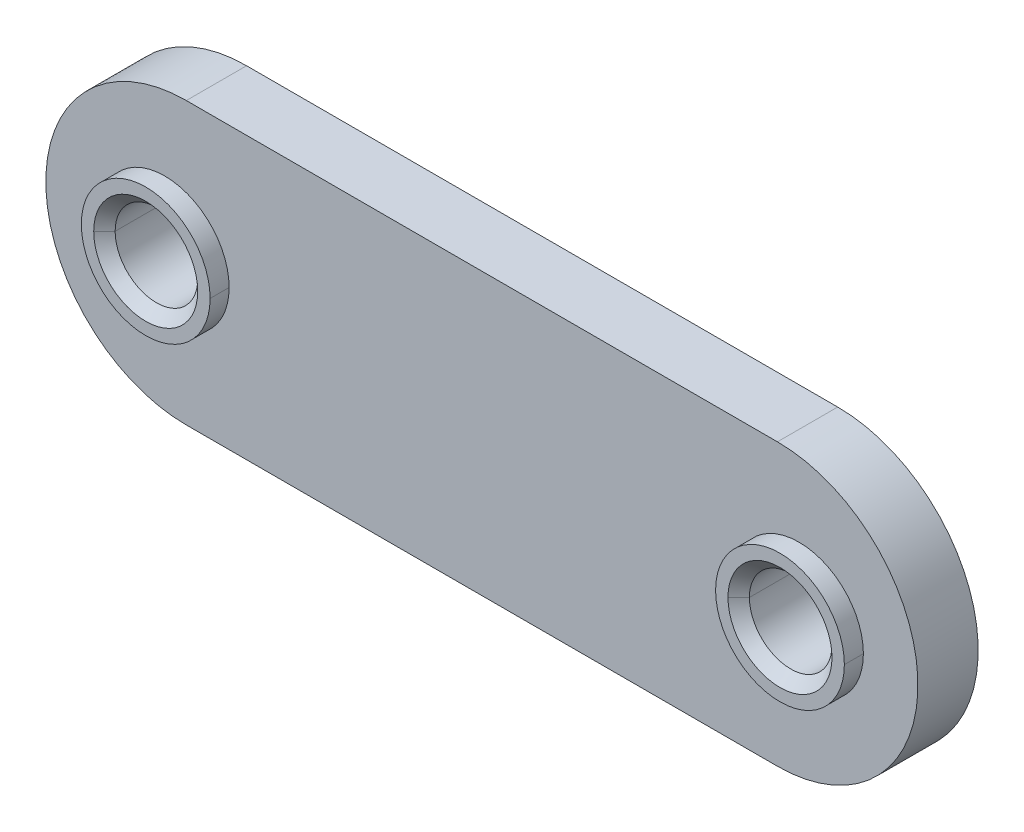
ISO-10303-21;
HEADER;
FILE_DESCRIPTION(('STEP AP214'),'2;1');
FILE_NAME('part.step','',(''),(''),'','','');
FILE_SCHEMA(('AUTOMOTIVE_DESIGN { 1 0 10303 214 1 1 1 1 }'));
ENDSEC;
DATA;
#1=APPLICATION_CONTEXT('core data for automotive mechanical design processes');
#2=APPLICATION_PROTOCOL_DEFINITION('international standard','automotive_design',2000,#1);
#3=PRODUCT_CONTEXT('',#1,'mechanical');
#4=PRODUCT('Part','Part','',(#3));
#5=PRODUCT_RELATED_PRODUCT_CATEGORY('part','',(#4));
#6=PRODUCT_DEFINITION_FORMATION('','',#4);
#7=PRODUCT_DEFINITION_CONTEXT('part definition',#1,'design');
#8=PRODUCT_DEFINITION('design','',#6,#7);
#9=PRODUCT_DEFINITION_SHAPE('','',#8);
#10=(LENGTH_UNIT() NAMED_UNIT(*) SI_UNIT(.MILLI.,.METRE.));
#11=(NAMED_UNIT(*) PLANE_ANGLE_UNIT() SI_UNIT($,.RADIAN.));
#12=(NAMED_UNIT(*) SI_UNIT($,.STERADIAN.) SOLID_ANGLE_UNIT());
#13=UNCERTAINTY_MEASURE_WITH_UNIT(LENGTH_MEASURE(1.E-05),#10,'distance_accuracy_value','');
#14=(GEOMETRIC_REPRESENTATION_CONTEXT(3) GLOBAL_UNCERTAINTY_ASSIGNED_CONTEXT((#13)) GLOBAL_UNIT_ASSIGNED_CONTEXT((#10,
#11,#12)) REPRESENTATION_CONTEXT('',''));
#15=CARTESIAN_POINT('',(0.,0.,0.));
#16=DIRECTION('',(0.,0.,1.));
#17=DIRECTION('',(1.,0.,0.));
#18=AXIS2_PLACEMENT_3D('',#15,#16,#17);
#19=CARTESIAN_POINT('',(27.9781,0.,1.9685));
#20=DIRECTION('',(0.,0.,-1.));
#21=DIRECTION('',(-1.,0.,0.));
#22=AXIS2_PLACEMENT_3D('',#19,#20,#21);
#23=PLANE('',#22);
#24=CARTESIAN_POINT('',(25.4,0.,1.9685));
#25=DIRECTION('',(0.,0.,1.));
#26=DIRECTION('',(1.,0.,0.));
#27=AXIS2_PLACEMENT_3D('',#24,#25,#26);
#28=CIRCLE('',#27,2.0828);
#29=CARTESIAN_POINT('',(27.4828,0.,1.9685));
#30=VERTEX_POINT('',#29);
#31=CARTESIAN_POINT('',(23.3171999999989,0.,1.9684999999989));
#32=VERTEX_POINT('',#31);
#33=EDGE_CURVE('E11',#30,#32,#28,.T.);
#34=ORIENTED_EDGE('',*,*,#33,.F.);
#35=CARTESIAN_POINT('',(25.4,0.,1.9685));
#36=DIRECTION('',(0.,0.,1.));
#37=DIRECTION('',(1.,0.,0.));
#38=AXIS2_PLACEMENT_3D('',#35,#36,#37);
#39=CIRCLE('',#38,2.0828);
#40=EDGE_CURVE('E25',#32,#30,#39,.T.);
#41=ORIENTED_EDGE('',*,*,#40,.F.);
#42=EDGE_LOOP('',(#34,#41));
#43=FACE_BOUND('',#42,.T.);
#44=CARTESIAN_POINT('',(25.4,0.,1.9685));
#45=DIRECTION('',(0.,0.,1.));
#46=DIRECTION('',(1.,0.,0.));
#47=AXIS2_PLACEMENT_3D('',#44,#45,#46);
#48=CIRCLE('',#47,2.5781);
#49=CARTESIAN_POINT('',(27.9781,0.,1.9685));
#50=VERTEX_POINT('',#49);
#51=CARTESIAN_POINT('',(22.8219,0.,1.9685));
#52=VERTEX_POINT('',#51);
#53=EDGE_CURVE('E348',#50,#52,#48,.T.);
#54=ORIENTED_EDGE('',*,*,#53,.T.);
#55=CARTESIAN_POINT('',(25.4,0.,1.9685));
#56=DIRECTION('',(0.,0.,1.));
#57=DIRECTION('',(1.,0.,0.));
#58=AXIS2_PLACEMENT_3D('',#55,#56,#57);
#59=CIRCLE('',#58,2.5781);
#60=EDGE_CURVE('E344',#52,#50,#59,.T.);
#61=ORIENTED_EDGE('',*,*,#60,.T.);
#62=EDGE_LOOP('',(#54,#61));
#63=FACE_BOUND('',#62,.T.);
#64=ADVANCED_FACE('F17',(#43,#63),#23,.F.);
#65=CARTESIAN_POINT('',(25.4,0.,1.9685));
#66=DIRECTION('',(0.,0.,-1.));
#67=DIRECTION('',(0.,1.,0.));
#68=AXIS2_PLACEMENT_3D('',#65,#66,#67);
#69=CYLINDRICAL_SURFACE('',#68,2.5781);
#70=CARTESIAN_POINT('',(25.4,0.,1.2065));
#71=DIRECTION('',(0.,0.,1.));
#72=DIRECTION('',(1.,0.,0.));
#73=AXIS2_PLACEMENT_3D('',#70,#71,#72);
#74=CIRCLE('',#73,2.5781);
#75=CARTESIAN_POINT('',(22.8219,0.,1.2065));
#76=VERTEX_POINT('',#75);
#77=CARTESIAN_POINT('',(27.9781,0.,1.2065));
#78=VERTEX_POINT('',#77);
#79=EDGE_CURVE('E340',#76,#78,#74,.T.);
#80=ORIENTED_EDGE('',*,*,#79,.T.);
#81=DIRECTION('',(0.,0.,-1.));
#82=VECTOR('',#81,1.);
#83=CARTESIAN_POINT('',(27.9781,0.,1.9685));
#84=LINE('',#83,#82);
#85=EDGE_CURVE('E335',#50,#78,#84,.T.);
#86=ORIENTED_EDGE('',*,*,#85,.F.);
#87=ORIENTED_EDGE('',*,*,#60,.F.);
#88=DIRECTION('',(0.,0.,-1.));
#89=VECTOR('',#88,1.);
#90=CARTESIAN_POINT('',(22.8219,0.,1.9685));
#91=LINE('',#90,#89);
#92=EDGE_CURVE('E331',#52,#76,#91,.T.);
#93=ORIENTED_EDGE('',*,*,#92,.T.);
#94=EDGE_LOOP('',(#80,#86,#87,#93));
#95=FACE_BOUND('',#94,.T.);
#96=ADVANCED_FACE('F363',(#95),#69,.T.);
#97=CARTESIAN_POINT('',(25.4,0.,1.9685));
#98=DIRECTION('',(0.,0.,-1.));
#99=DIRECTION('',(0.,-1.,0.));
#100=AXIS2_PLACEMENT_3D('',#97,#98,#99);
#101=CYLINDRICAL_SURFACE('',#100,2.5781);
#102=ORIENTED_EDGE('',*,*,#53,.F.);
#103=ORIENTED_EDGE('',*,*,#85,.T.);
#104=CARTESIAN_POINT('',(25.4,0.,1.2065));
#105=DIRECTION('',(0.,0.,1.));
#106=DIRECTION('',(1.,0.,0.));
#107=AXIS2_PLACEMENT_3D('',#104,#105,#106);
#108=CIRCLE('',#107,2.5781);
#109=EDGE_CURVE('E326',#78,#76,#108,.T.);
#110=ORIENTED_EDGE('',*,*,#109,.T.);
#111=ORIENTED_EDGE('',*,*,#92,.F.);
#112=EDGE_LOOP('',(#102,#103,#110,#111));
#113=FACE_BOUND('',#112,.T.);
#114=ADVANCED_FACE('F364',(#113),#101,.T.);
#115=CARTESIAN_POINT('',(0.8636,0.,1.2065));
#116=DIRECTION('',(0.,0.,1.));
#117=DIRECTION('',(1.,0.,0.));
#118=AXIS2_PLACEMENT_3D('',#115,#116,#117);
#119=PLANE('',#118);
#120=ORIENTED_EDGE('',*,*,#109,.F.);
#121=ORIENTED_EDGE('',*,*,#79,.F.);
#122=EDGE_LOOP('',(#120,#121));
#123=FACE_BOUND('',#122,.T.);
#124=CARTESIAN_POINT('',(0.,0.,1.2065));
#125=DIRECTION('',(0.,0.,1.));
#126=DIRECTION('',(1.,0.,0.));
#127=AXIS2_PLACEMENT_3D('',#124,#125,#126);
#128=CIRCLE('',#127,2.5781);
#129=CARTESIAN_POINT('',(2.5781,0.,1.2065));
#130=VERTEX_POINT('',#129);
#131=CARTESIAN_POINT('',(-2.5781,0.,1.2065));
#132=VERTEX_POINT('',#131);
#133=EDGE_CURVE('E321',#130,#132,#128,.T.);
#134=ORIENTED_EDGE('',*,*,#133,.F.);
#135=CARTESIAN_POINT('',(0.,0.,1.2065));
#136=DIRECTION('',(0.,0.,1.));
#137=DIRECTION('',(1.,0.,0.));
#138=AXIS2_PLACEMENT_3D('',#135,#136,#137);
#139=CIRCLE('',#138,2.5781);
#140=EDGE_CURVE('E316',#132,#130,#139,.T.);
#141=ORIENTED_EDGE('',*,*,#140,.F.);
#142=EDGE_LOOP('',(#134,#141));
#143=FACE_BOUND('',#142,.T.);
#144=DIRECTION('',(-1.,0.,0.));
#145=VECTOR('',#144,1.);
#146=CARTESIAN_POINT('',(24.5364,5.6261,1.2065));
#147=LINE('',#146,#145);
#148=CARTESIAN_POINT('',(24.5364,5.6261,1.2065));
#149=VERTEX_POINT('',#148);
#150=CARTESIAN_POINT('',(0.8636,5.6261,1.2065));
#151=VERTEX_POINT('',#150);
#152=EDGE_CURVE('E312',#149,#151,#147,.T.);
#153=ORIENTED_EDGE('',*,*,#152,.T.);
#154=CARTESIAN_POINT('',(0.8636,0.,1.2065));
#155=DIRECTION('',(0.,0.,1.));
#156=DIRECTION('',(1.,0.,0.));
#157=AXIS2_PLACEMENT_3D('',#154,#155,#156);
#158=CIRCLE('',#157,5.6261);
#159=CARTESIAN_POINT('',(0.8636,-5.6261,1.2065));
#160=VERTEX_POINT('',#159);
#161=EDGE_CURVE('E308',#151,#160,#158,.T.);
#162=ORIENTED_EDGE('',*,*,#161,.T.);
#163=DIRECTION('',(1.,0.,0.));
#164=VECTOR('',#163,1.);
#165=CARTESIAN_POINT('',(0.8636,-5.6261,1.2065));
#166=LINE('',#165,#164);
#167=CARTESIAN_POINT('',(24.5364,-5.6261,1.2065));
#168=VERTEX_POINT('',#167);
#169=EDGE_CURVE('E304',#160,#168,#166,.T.);
#170=ORIENTED_EDGE('',*,*,#169,.T.);
#171=CARTESIAN_POINT('',(24.5364,0.,1.2065));
#172=DIRECTION('',(0.,0.,1.));
#173=DIRECTION('',(1.,0.,0.));
#174=AXIS2_PLACEMENT_3D('',#171,#172,#173);
#175=CIRCLE('',#174,5.6261);
#176=EDGE_CURVE('E300',#168,#149,#175,.T.);
#177=ORIENTED_EDGE('',*,*,#176,.T.);
#178=EDGE_LOOP('',(#153,#162,#170,#177));
#179=FACE_BOUND('',#178,.T.);
#180=ADVANCED_FACE('F368',(#123,#143,#179),#119,.T.);
#181=CARTESIAN_POINT('',(24.5364,0.,1.2065));
#182=DIRECTION('',(0.,0.,1.));
#183=DIRECTION('',(-1.,0.,0.));
#184=AXIS2_PLACEMENT_3D('',#181,#182,#183);
#185=CYLINDRICAL_SURFACE('',#184,5.6261);
#186=CARTESIAN_POINT('',(24.5364,0.,-1.2065));
#187=DIRECTION('',(0.,0.,1.));
#188=DIRECTION('',(1.,0.,0.));
#189=AXIS2_PLACEMENT_3D('',#186,#187,#188);
#190=CIRCLE('',#189,5.6261);
#191=CARTESIAN_POINT('',(24.5364,-5.6261,-1.2065));
#192=VERTEX_POINT('',#191);
#193=CARTESIAN_POINT('',(24.5364,5.6261,-1.2065));
#194=VERTEX_POINT('',#193);
#195=EDGE_CURVE('E296',#192,#194,#190,.T.);
#196=ORIENTED_EDGE('',*,*,#195,.T.);
#197=DIRECTION('',(0.,0.,-1.));
#198=VECTOR('',#197,1.);
#199=CARTESIAN_POINT('',(24.5364,5.6261,1.2065));
#200=LINE('',#199,#198);
#201=EDGE_CURVE('E291',#149,#194,#200,.T.);
#202=ORIENTED_EDGE('',*,*,#201,.F.);
#203=ORIENTED_EDGE('',*,*,#176,.F.);
#204=DIRECTION('',(0.,0.,-1.));
#205=VECTOR('',#204,1.);
#206=CARTESIAN_POINT('',(24.5364,-5.6261,1.2065));
#207=LINE('',#206,#205);
#208=EDGE_CURVE('E287',#168,#192,#207,.T.);
#209=ORIENTED_EDGE('',*,*,#208,.T.);
#210=EDGE_LOOP('',(#196,#202,#203,#209));
#211=FACE_BOUND('',#210,.T.);
#212=ADVANCED_FACE('F371',(#211),#185,.T.);
#213=CARTESIAN_POINT('',(0.8636,-5.6261,1.2065));
#214=DIRECTION('',(0.,1.,0.));
#215=DIRECTION('',(0.,0.,1.));
#216=AXIS2_PLACEMENT_3D('',#213,#214,#215);
#217=PLANE('',#216);
#218=DIRECTION('',(1.,0.,0.));
#219=VECTOR('',#218,1.);
#220=CARTESIAN_POINT('',(0.8636,-5.6261,-1.2065));
#221=LINE('',#220,#219);
#222=CARTESIAN_POINT('',(0.8636,-5.6261,-1.2065));
#223=VERTEX_POINT('',#222);
#224=EDGE_CURVE('E282',#223,#192,#221,.T.);
#225=ORIENTED_EDGE('',*,*,#224,.T.);
#226=ORIENTED_EDGE('',*,*,#208,.F.);
#227=ORIENTED_EDGE('',*,*,#169,.F.);
#228=DIRECTION('',(0.,0.,-1.));
#229=VECTOR('',#228,1.);
#230=CARTESIAN_POINT('',(0.8636,-5.6261,1.2065));
#231=LINE('',#230,#229);
#232=EDGE_CURVE('E278',#160,#223,#231,.T.);
#233=ORIENTED_EDGE('',*,*,#232,.T.);
#234=EDGE_LOOP('',(#225,#226,#227,#233));
#235=FACE_BOUND('',#234,.T.);
#236=ADVANCED_FACE('F393',(#235),#217,.F.);
#237=CARTESIAN_POINT('',(0.8636,0.,1.2065));
#238=DIRECTION('',(0.,0.,1.));
#239=DIRECTION('',(1.,0.,0.));
#240=AXIS2_PLACEMENT_3D('',#237,#238,#239);
#241=CYLINDRICAL_SURFACE('',#240,5.6261);
#242=CARTESIAN_POINT('',(0.8636,0.,-1.2065));
#243=DIRECTION('',(0.,0.,1.));
#244=DIRECTION('',(1.,0.,0.));
#245=AXIS2_PLACEMENT_3D('',#242,#243,#244);
#246=CIRCLE('',#245,5.6261);
#247=CARTESIAN_POINT('',(0.8636,5.6261,-1.2065));
#248=VERTEX_POINT('',#247);
#249=EDGE_CURVE('E273',#248,#223,#246,.T.);
#250=ORIENTED_EDGE('',*,*,#249,.T.);
#251=ORIENTED_EDGE('',*,*,#232,.F.);
#252=ORIENTED_EDGE('',*,*,#161,.F.);
#253=DIRECTION('',(0.,0.,-1.));
#254=VECTOR('',#253,1.);
#255=CARTESIAN_POINT('',(0.8636,5.6261,1.2065));
#256=LINE('',#255,#254);
#257=EDGE_CURVE('E269',#151,#248,#256,.T.);
#258=ORIENTED_EDGE('',*,*,#257,.T.);
#259=EDGE_LOOP('',(#250,#251,#252,#258));
#260=FACE_BOUND('',#259,.T.);
#261=ADVANCED_FACE('F383',(#260),#241,.T.);
#262=CARTESIAN_POINT('',(24.5364,5.6261,1.2065));
#263=DIRECTION('',(0.,-1.,0.));
#264=DIRECTION('',(0.,0.,-1.));
#265=AXIS2_PLACEMENT_3D('',#262,#263,#264);
#266=PLANE('',#265);
#267=DIRECTION('',(-1.,0.,0.));
#268=VECTOR('',#267,1.);
#269=CARTESIAN_POINT('',(24.5364,5.6261,-1.2065));
#270=LINE('',#269,#268);
#271=EDGE_CURVE('E264',#194,#248,#270,.T.);
#272=ORIENTED_EDGE('',*,*,#271,.T.);
#273=ORIENTED_EDGE('',*,*,#257,.F.);
#274=ORIENTED_EDGE('',*,*,#152,.F.);
#275=ORIENTED_EDGE('',*,*,#201,.T.);
#276=EDGE_LOOP('',(#272,#273,#274,#275));
#277=FACE_BOUND('',#276,.T.);
#278=ADVANCED_FACE('F384',(#277),#266,.F.);
#279=CARTESIAN_POINT('',(0.8636,0.,-1.2065));
#280=DIRECTION('',(0.,0.,1.));
#281=DIRECTION('',(1.,0.,0.));
#282=AXIS2_PLACEMENT_3D('',#279,#280,#281);
#283=PLANE('',#282);
#284=CARTESIAN_POINT('',(25.4,0.,-1.2065));
#285=DIRECTION('',(0.,0.,1.));
#286=DIRECTION('',(1.,0.,0.));
#287=AXIS2_PLACEMENT_3D('',#284,#285,#286);
#288=CIRCLE('',#287,2.0828);
#289=CARTESIAN_POINT('',(27.4828,0.,-1.2065));
#290=VERTEX_POINT('',#289);
#291=CARTESIAN_POINT('',(23.3172,0.,-1.2065));
#292=VERTEX_POINT('',#291);
#293=EDGE_CURVE('E260',#290,#292,#288,.T.);
#294=ORIENTED_EDGE('',*,*,#293,.T.);
#295=CARTESIAN_POINT('',(25.4,0.,-1.2065));
#296=DIRECTION('',(0.,0.,1.));
#297=DIRECTION('',(1.,0.,0.));
#298=AXIS2_PLACEMENT_3D('',#295,#296,#297);
#299=CIRCLE('',#298,2.0828);
#300=EDGE_CURVE('E256',#292,#290,#299,.T.);
#301=ORIENTED_EDGE('',*,*,#300,.T.);
#302=EDGE_LOOP('',(#294,#301));
#303=FACE_BOUND('',#302,.T.);
#304=CARTESIAN_POINT('',(0.,0.,-1.2065));
#305=DIRECTION('',(0.,0.,1.));
#306=DIRECTION('',(1.,0.,0.));
#307=AXIS2_PLACEMENT_3D('',#304,#305,#306);
#308=CIRCLE('',#307,2.0828);
#309=CARTESIAN_POINT('',(2.0828,0.,-1.2065));
#310=VERTEX_POINT('',#309);
#311=CARTESIAN_POINT('',(-2.0828,0.,-1.2065));
#312=VERTEX_POINT('',#311);
#313=EDGE_CURVE('E252',#310,#312,#308,.T.);
#314=ORIENTED_EDGE('',*,*,#313,.T.);
#315=CARTESIAN_POINT('',(0.,0.,-1.2065));
#316=DIRECTION('',(0.,0.,1.));
#317=DIRECTION('',(1.,0.,0.));
#318=AXIS2_PLACEMENT_3D('',#315,#316,#317);
#319=CIRCLE('',#318,2.0828);
#320=EDGE_CURVE('E248',#312,#310,#319,.T.);
#321=ORIENTED_EDGE('',*,*,#320,.T.);
#322=EDGE_LOOP('',(#314,#321));
#323=FACE_BOUND('',#322,.T.);
#324=ORIENTED_EDGE('',*,*,#271,.F.);
#325=ORIENTED_EDGE('',*,*,#195,.F.);
#326=ORIENTED_EDGE('',*,*,#224,.F.);
#327=ORIENTED_EDGE('',*,*,#249,.F.);
#328=EDGE_LOOP('',(#324,#325,#326,#327));
#329=FACE_BOUND('',#328,.T.);
#330=ADVANCED_FACE('F390',(#303,#323,#329),#283,.F.);
#331=CARTESIAN_POINT('',(0.,0.,-1.2065));
#332=DIRECTION('',(0.,0.,-1.));
#333=DIRECTION('',(0.,1.,0.));
#334=AXIS2_PLACEMENT_3D('',#331,#332,#333);
#335=CONICAL_SURFACE('',#334,2.0828,0.7853981634);
#336=ORIENTED_EDGE('',*,*,#320,.F.);
#337=DIRECTION('',(-0.707106781188352,0.,-0.707106781184743));
#338=VECTOR('',#337,1.);
#339=CARTESIAN_POINT('',(-1.6535399999989,0.,-0.777240000001095));
#340=LINE('',#339,#338);
#341=CARTESIAN_POINT('',(-1.6535399999989,0.,-0.777240000001095));
#342=VERTEX_POINT('',#341);
#343=EDGE_CURVE('E243',#342,#312,#340,.T.);
#344=ORIENTED_EDGE('',*,*,#343,.F.);
#345=CARTESIAN_POINT('',(0.,0.,-0.77724));
#346=DIRECTION('',(0.,0.,1.));
#347=DIRECTION('',(1.,0.,0.));
#348=AXIS2_PLACEMENT_3D('',#345,#346,#347);
#349=CIRCLE('',#348,1.65354);
#350=CARTESIAN_POINT('',(1.65354,0.,-0.77724));
#351=VERTEX_POINT('',#350);
#352=EDGE_CURVE('E239',#342,#351,#349,.T.);
#353=ORIENTED_EDGE('',*,*,#352,.T.);
#354=DIRECTION('',(0.707106781188352,0.,-0.707106781184743));
#355=VECTOR('',#354,1.);
#356=CARTESIAN_POINT('',(1.6535399999989,0.,-0.777240000001095));
#357=LINE('',#356,#355);
#358=EDGE_CURVE('E234',#351,#310,#357,.T.);
#359=ORIENTED_EDGE('',*,*,#358,.T.);
#360=EDGE_LOOP('',(#336,#344,#353,#359));
#361=FACE_BOUND('',#360,.T.);
#362=ADVANCED_FACE('F455',(#361),#335,.F.);
#363=CARTESIAN_POINT('',(0.,0.,-1.2065));
#364=DIRECTION('',(0.,0.,-1.));
#365=DIRECTION('',(0.,-1.,0.));
#366=AXIS2_PLACEMENT_3D('',#363,#364,#365);
#367=CONICAL_SURFACE('',#366,2.0828,0.7853981634);
#368=CARTESIAN_POINT('',(0.,0.,-0.77724));
#369=DIRECTION('',(0.,0.,1.));
#370=DIRECTION('',(1.,0.,0.));
#371=AXIS2_PLACEMENT_3D('',#368,#369,#370);
#372=CIRCLE('',#371,1.65354);
#373=EDGE_CURVE('E229',#351,#342,#372,.T.);
#374=ORIENTED_EDGE('',*,*,#373,.T.);
#375=ORIENTED_EDGE('',*,*,#343,.T.);
#376=ORIENTED_EDGE('',*,*,#313,.F.);
#377=ORIENTED_EDGE('',*,*,#358,.F.);
#378=EDGE_LOOP('',(#374,#375,#376,#377));
#379=FACE_BOUND('',#378,.T.);
#380=ADVANCED_FACE('F465',(#379),#367,.F.);
#381=CARTESIAN_POINT('',(0.,0.,1.9685));
#382=DIRECTION('',(0.,0.,-1.));
#383=DIRECTION('',(0.,-1.,0.));
#384=AXIS2_PLACEMENT_3D('',#381,#382,#383);
#385=CYLINDRICAL_SURFACE('',#384,1.65354);
#386=CARTESIAN_POINT('',(0.,0.,1.53924));
#387=DIRECTION('',(0.,0.,1.));
#388=DIRECTION('',(1.,0.,0.));
#389=AXIS2_PLACEMENT_3D('',#386,#387,#388);
#390=CIRCLE('',#389,1.65354);
#391=CARTESIAN_POINT('',(1.65354,0.,1.53924));
#392=VERTEX_POINT('',#391);
#393=CARTESIAN_POINT('',(-1.65354,0.,1.53924));
#394=VERTEX_POINT('',#393);
#395=EDGE_CURVE('E225',#392,#394,#390,.T.);
#396=ORIENTED_EDGE('',*,*,#395,.T.);
#397=DIRECTION('',(0.,0.,-1.));
#398=VECTOR('',#397,1.);
#399=CARTESIAN_POINT('',(-1.65354,0.,1.53924));
#400=LINE('',#399,#398);
#401=EDGE_CURVE('E220',#394,#342,#400,.T.);
#402=ORIENTED_EDGE('',*,*,#401,.T.);
#403=ORIENTED_EDGE('',*,*,#373,.F.);
#404=DIRECTION('',(0.,0.,-1.));
#405=VECTOR('',#404,1.);
#406=CARTESIAN_POINT('',(1.65354,0.,1.53924));
#407=LINE('',#406,#405);
#408=EDGE_CURVE('E215',#392,#351,#407,.T.);
#409=ORIENTED_EDGE('',*,*,#408,.F.);
#410=EDGE_LOOP('',(#396,#402,#403,#409));
#411=FACE_BOUND('',#410,.T.);
#412=ADVANCED_FACE('F475',(#411),#385,.F.);
#413=CARTESIAN_POINT('',(0.,0.,1.9685));
#414=DIRECTION('',(0.,0.,-1.));
#415=DIRECTION('',(0.,1.,0.));
#416=AXIS2_PLACEMENT_3D('',#413,#414,#415);
#417=CYLINDRICAL_SURFACE('',#416,1.65354);
#418=ORIENTED_EDGE('',*,*,#352,.F.);
#419=ORIENTED_EDGE('',*,*,#401,.F.);
#420=CARTESIAN_POINT('',(0.,0.,1.53924));
#421=DIRECTION('',(0.,0.,1.));
#422=DIRECTION('',(1.,0.,0.));
#423=AXIS2_PLACEMENT_3D('',#420,#421,#422);
#424=CIRCLE('',#423,1.65354);
#425=EDGE_CURVE('E210',#394,#392,#424,.T.);
#426=ORIENTED_EDGE('',*,*,#425,.T.);
#427=ORIENTED_EDGE('',*,*,#408,.T.);
#428=EDGE_LOOP('',(#418,#419,#426,#427));
#429=FACE_BOUND('',#428,.T.);
#430=ADVANCED_FACE('F485',(#429),#417,.F.);
#431=CARTESIAN_POINT('',(0.,0.,1.53924));
#432=DIRECTION('',(0.,0.,1.));
#433=DIRECTION('',(0.,1.,0.));
#434=AXIS2_PLACEMENT_3D('',#431,#432,#433);
#435=CONICAL_SURFACE('',#434,1.65354,0.7853981634);
#436=ORIENTED_EDGE('',*,*,#425,.F.);
#437=DIRECTION('',(-0.707106781188352,0.,0.707106781184743));
#438=VECTOR('',#437,1.);
#439=CARTESIAN_POINT('',(-1.65354,0.,1.53924));
#440=LINE('',#439,#438);
#441=CARTESIAN_POINT('',(-2.0828000000011,0.,1.9684999999989));
#442=VERTEX_POINT('',#441);
#443=EDGE_CURVE('E206',#394,#442,#440,.T.);
#444=ORIENTED_EDGE('',*,*,#443,.T.);
#445=CARTESIAN_POINT('',(0.,0.,1.9685));
#446=DIRECTION('',(0.,0.,1.));
#447=DIRECTION('',(1.,0.,0.));
#448=AXIS2_PLACEMENT_3D('',#445,#446,#447);
#449=CIRCLE('',#448,2.0828);
#450=CARTESIAN_POINT('',(2.0828,0.,1.9685));
#451=VERTEX_POINT('',#450);
#452=EDGE_CURVE('E202',#442,#451,#449,.T.);
#453=ORIENTED_EDGE('',*,*,#452,.T.);
#454=DIRECTION('',(0.707106781188352,0.,0.707106781184743));
#455=VECTOR('',#454,1.);
#456=CARTESIAN_POINT('',(1.65354,0.,1.53924));
#457=LINE('',#456,#455);
#458=EDGE_CURVE('E197',#392,#451,#457,.T.);
#459=ORIENTED_EDGE('',*,*,#458,.F.);
#460=EDGE_LOOP('',(#436,#444,#453,#459));
#461=FACE_BOUND('',#460,.T.);
#462=ADVANCED_FACE('F495',(#461),#435,.F.);
#463=CARTESIAN_POINT('',(0.,0.,1.53924));
#464=DIRECTION('',(0.,0.,1.));
#465=DIRECTION('',(0.,-1.,0.));
#466=AXIS2_PLACEMENT_3D('',#463,#464,#465);
#467=CONICAL_SURFACE('',#466,1.65354,0.7853981634);
#468=CARTESIAN_POINT('',(0.,0.,1.9685));
#469=DIRECTION('',(0.,0.,1.));
#470=DIRECTION('',(1.,0.,0.));
#471=AXIS2_PLACEMENT_3D('',#468,#469,#470);
#472=CIRCLE('',#471,2.0828);
#473=EDGE_CURVE('E192',#451,#442,#472,.T.);
#474=ORIENTED_EDGE('',*,*,#473,.T.);
#475=ORIENTED_EDGE('',*,*,#443,.F.);
#476=ORIENTED_EDGE('',*,*,#395,.F.);
#477=ORIENTED_EDGE('',*,*,#458,.T.);
#478=EDGE_LOOP('',(#474,#475,#476,#477));
#479=FACE_BOUND('',#478,.T.);
#480=ADVANCED_FACE('F505',(#479),#467,.F.);
#481=CARTESIAN_POINT('',(2.5781,0.,1.9685));
#482=DIRECTION('',(0.,0.,-1.));
#483=DIRECTION('',(-1.,0.,0.));
#484=AXIS2_PLACEMENT_3D('',#481,#482,#483);
#485=PLANE('',#484);
#486=ORIENTED_EDGE('',*,*,#473,.F.);
#487=ORIENTED_EDGE('',*,*,#452,.F.);
#488=EDGE_LOOP('',(#486,#487));
#489=FACE_BOUND('',#488,.T.);
#490=CARTESIAN_POINT('',(0.,0.,1.9685));
#491=DIRECTION('',(0.,0.,1.));
#492=DIRECTION('',(1.,0.,0.));
#493=AXIS2_PLACEMENT_3D('',#490,#491,#492);
#494=CIRCLE('',#493,2.5781);
#495=CARTESIAN_POINT('',(2.5781,0.,1.9685));
#496=VERTEX_POINT('',#495);
#497=CARTESIAN_POINT('',(-2.5781,0.,1.9685));
#498=VERTEX_POINT('',#497);
#499=EDGE_CURVE('E188',#496,#498,#494,.T.);
#500=ORIENTED_EDGE('',*,*,#499,.T.);
#501=CARTESIAN_POINT('',(0.,0.,1.9685));
#502=DIRECTION('',(0.,0.,1.));
#503=DIRECTION('',(1.,0.,0.));
#504=AXIS2_PLACEMENT_3D('',#501,#502,#503);
#505=CIRCLE('',#504,2.5781);
#506=EDGE_CURVE('E184',#498,#496,#505,.T.);
#507=ORIENTED_EDGE('',*,*,#506,.T.);
#508=EDGE_LOOP('',(#500,#507));
#509=FACE_BOUND('',#508,.T.);
#510=ADVANCED_FACE('F515',(#489,#509),#485,.F.);
#511=CARTESIAN_POINT('',(0.,0.,1.9685));
#512=DIRECTION('',(0.,0.,-1.));
#513=DIRECTION('',(0.,1.,0.));
#514=AXIS2_PLACEMENT_3D('',#511,#512,#513);
#515=CYLINDRICAL_SURFACE('',#514,2.5781);
#516=ORIENTED_EDGE('',*,*,#140,.T.);
#517=DIRECTION('',(0.,0.,-1.));
#518=VECTOR('',#517,1.);
#519=CARTESIAN_POINT('',(2.5781,0.,1.9685));
#520=LINE('',#519,#518);
#521=EDGE_CURVE('E179',#496,#130,#520,.T.);
#522=ORIENTED_EDGE('',*,*,#521,.F.);
#523=ORIENTED_EDGE('',*,*,#506,.F.);
#524=DIRECTION('',(0.,0.,-1.));
#525=VECTOR('',#524,1.);
#526=CARTESIAN_POINT('',(-2.5781,0.,1.9685));
#527=LINE('',#526,#525);
#528=EDGE_CURVE('E174',#498,#132,#527,.T.);
#529=ORIENTED_EDGE('',*,*,#528,.T.);
#530=EDGE_LOOP('',(#516,#522,#523,#529));
#531=FACE_BOUND('',#530,.T.);
#532=ADVANCED_FACE('F525',(#531),#515,.T.);
#533=CARTESIAN_POINT('',(0.,0.,1.9685));
#534=DIRECTION('',(0.,0.,-1.));
#535=DIRECTION('',(0.,-1.,0.));
#536=AXIS2_PLACEMENT_3D('',#533,#534,#535);
#537=CYLINDRICAL_SURFACE('',#536,2.5781);
#538=ORIENTED_EDGE('',*,*,#499,.F.);
#539=ORIENTED_EDGE('',*,*,#521,.T.);
#540=ORIENTED_EDGE('',*,*,#133,.T.);
#541=ORIENTED_EDGE('',*,*,#528,.F.);
#542=EDGE_LOOP('',(#538,#539,#540,#541));
#543=FACE_BOUND('',#542,.T.);
#544=ADVANCED_FACE('F535',(#543),#537,.T.);
#545=CARTESIAN_POINT('',(25.4,0.,-1.2065));
#546=DIRECTION('',(0.,0.,-1.));
#547=DIRECTION('',(0.,1.,0.));
#548=AXIS2_PLACEMENT_3D('',#545,#546,#547);
#549=CONICAL_SURFACE('',#548,2.0828,0.7853981634);
#550=ORIENTED_EDGE('',*,*,#300,.F.);
#551=DIRECTION('',(-0.707106781188356,0.,-0.707106781184739));
#552=VECTOR('',#551,1.);
#553=CARTESIAN_POINT('',(23.7464600000011,0.,-0.777240000001095));
#554=LINE('',#553,#552);
#555=CARTESIAN_POINT('',(23.7464600000011,0.,-0.777240000001095));
#556=VERTEX_POINT('',#555);
#557=EDGE_CURVE('E169',#556,#292,#554,.T.);
#558=ORIENTED_EDGE('',*,*,#557,.F.);
#559=CARTESIAN_POINT('',(25.4,0.,-0.77724));
#560=DIRECTION('',(0.,0.,1.));
#561=DIRECTION('',(1.,0.,0.));
#562=AXIS2_PLACEMENT_3D('',#559,#560,#561);
#563=CIRCLE('',#562,1.65354);
#564=CARTESIAN_POINT('',(27.05354,0.,-0.77724));
#565=VERTEX_POINT('',#564);
#566=EDGE_CURVE('E165',#556,#565,#563,.T.);
#567=ORIENTED_EDGE('',*,*,#566,.T.);
#568=DIRECTION('',(0.707106781188356,0.,-0.707106781184739));
#569=VECTOR('',#568,1.);
#570=CARTESIAN_POINT('',(27.0535399999989,0.,-0.777240000001095));
#571=LINE('',#570,#569);
#572=EDGE_CURVE('E153',#565,#290,#571,.T.);
#573=ORIENTED_EDGE('',*,*,#572,.T.);
#574=EDGE_LOOP('',(#550,#558,#567,#573));
#575=FACE_BOUND('',#574,.T.);
#576=ADVANCED_FACE('F545',(#575),#549,.F.);
#577=CARTESIAN_POINT('',(25.4,0.,-1.2065));
#578=DIRECTION('',(0.,0.,-1.));
#579=DIRECTION('',(0.,-1.,0.));
#580=AXIS2_PLACEMENT_3D('',#577,#578,#579);
#581=CONICAL_SURFACE('',#580,2.0828,0.7853981634);
#582=CARTESIAN_POINT('',(25.4,0.,-0.77724));
#583=DIRECTION('',(0.,0.,1.));
#584=DIRECTION('',(1.,0.,0.));
#585=AXIS2_PLACEMENT_3D('',#582,#583,#584);
#586=CIRCLE('',#585,1.65354);
#587=EDGE_CURVE('E133',#565,#556,#586,.T.);
#588=ORIENTED_EDGE('',*,*,#587,.T.);
#589=ORIENTED_EDGE('',*,*,#557,.T.);
#590=ORIENTED_EDGE('',*,*,#293,.F.);
#591=ORIENTED_EDGE('',*,*,#572,.F.);
#592=EDGE_LOOP('',(#588,#589,#590,#591));
#593=FACE_BOUND('',#592,.T.);
#594=ADVANCED_FACE('F555',(#593),#581,.F.);
#595=CARTESIAN_POINT('',(25.4,0.,1.9685));
#596=DIRECTION('',(0.,0.,-1.));
#597=DIRECTION('',(0.,-1.,0.));
#598=AXIS2_PLACEMENT_3D('',#595,#596,#597);
#599=CYLINDRICAL_SURFACE('',#598,1.65354);
#600=CARTESIAN_POINT('',(25.4,0.,1.53924));
#601=DIRECTION('',(0.,0.,1.));
#602=DIRECTION('',(1.,0.,0.));
#603=AXIS2_PLACEMENT_3D('',#600,#601,#602);
#604=CIRCLE('',#603,1.65354);
#605=CARTESIAN_POINT('',(27.05354,0.,1.53924));
#606=VERTEX_POINT('',#605);
#607=CARTESIAN_POINT('',(23.74646,0.,1.53924));
#608=VERTEX_POINT('',#607);
#609=EDGE_CURVE('E130',#606,#608,#604,.T.);
#610=ORIENTED_EDGE('',*,*,#609,.T.);
#611=DIRECTION('',(0.,0.,-1.));
#612=VECTOR('',#611,1.);
#613=CARTESIAN_POINT('',(23.74646,0.,1.53924));
#614=LINE('',#613,#612);
#615=EDGE_CURVE('E136',#608,#556,#614,.T.);
#616=ORIENTED_EDGE('',*,*,#615,.T.);
#617=ORIENTED_EDGE('',*,*,#587,.F.);
#618=DIRECTION('',(0.,0.,-1.));
#619=VECTOR('',#618,1.);
#620=CARTESIAN_POINT('',(27.05354,0.,1.53924));
#621=LINE('',#620,#619);
#622=EDGE_CURVE('E125',#606,#565,#621,.T.);
#623=ORIENTED_EDGE('',*,*,#622,.F.);
#624=EDGE_LOOP('',(#610,#616,#617,#623));
#625=FACE_BOUND('',#624,.T.);
#626=ADVANCED_FACE('F127',(#625),#599,.F.);
#627=CARTESIAN_POINT('',(25.4,0.,1.9685));
#628=DIRECTION('',(0.,0.,-1.));
#629=DIRECTION('',(0.,1.,0.));
#630=AXIS2_PLACEMENT_3D('',#627,#628,#629);
#631=CYLINDRICAL_SURFACE('',#630,1.65354);
#632=ORIENTED_EDGE('',*,*,#566,.F.);
#633=ORIENTED_EDGE('',*,*,#615,.F.);
#634=CARTESIAN_POINT('',(25.4,0.,1.53924));
#635=DIRECTION('',(0.,0.,1.));
#636=DIRECTION('',(1.,0.,0.));
#637=AXIS2_PLACEMENT_3D('',#634,#635,#636);
#638=CIRCLE('',#637,1.65354);
#639=EDGE_CURVE('E137',#608,#606,#638,.T.);
#640=ORIENTED_EDGE('',*,*,#639,.T.);
#641=ORIENTED_EDGE('',*,*,#622,.T.);
#642=EDGE_LOOP('',(#632,#633,#640,#641));
#643=FACE_BOUND('',#642,.T.);
#644=ADVANCED_FACE('F141',(#643),#631,.F.);
#645=CARTESIAN_POINT('',(25.4,0.,1.53924));
#646=DIRECTION('',(0.,0.,1.));
#647=DIRECTION('',(0.,1.,0.));
#648=AXIS2_PLACEMENT_3D('',#645,#646,#647);
#649=CONICAL_SURFACE('',#648,1.65354,0.7853981634);
#650=ORIENTED_EDGE('',*,*,#639,.F.);
#651=DIRECTION('',(-0.707106781188351,0.,0.707106781184744));
#652=VECTOR('',#651,1.);
#653=CARTESIAN_POINT('',(23.74646,0.,1.53924));
#654=LINE('',#653,#652);
#655=EDGE_CURVE('E144',#608,#32,#654,.T.);
#656=ORIENTED_EDGE('',*,*,#655,.T.);
#657=ORIENTED_EDGE('',*,*,#40,.T.);
#658=DIRECTION('',(0.707106781188351,0.,0.707106781184744));
#659=VECTOR('',#658,1.);
#660=CARTESIAN_POINT('',(27.05354,0.,1.53924));
#661=LINE('',#660,#659);
#662=EDGE_CURVE('E147',#606,#30,#661,.T.);
#663=ORIENTED_EDGE('',*,*,#662,.F.);
#664=EDGE_LOOP('',(#650,#656,#657,#663));
#665=FACE_BOUND('',#664,.T.);
#666=ADVANCED_FACE('F148',(#665),#649,.F.);
#667=CARTESIAN_POINT('',(25.4,0.,1.53924));
#668=DIRECTION('',(0.,0.,1.));
#669=DIRECTION('',(0.,-1.,0.));
#670=AXIS2_PLACEMENT_3D('',#667,#668,#669);
#671=CONICAL_SURFACE('',#670,1.65354,0.7853981634);
#672=ORIENTED_EDGE('',*,*,#33,.T.);
#673=ORIENTED_EDGE('',*,*,#655,.F.);
#674=ORIENTED_EDGE('',*,*,#609,.F.);
#675=ORIENTED_EDGE('',*,*,#662,.T.);
#676=EDGE_LOOP('',(#672,#673,#674,#675));
#677=FACE_BOUND('',#676,.T.);
#678=ADVANCED_FACE('F151',(#677),#671,.F.);
#679=CLOSED_SHELL('',(#64,#96,#114,#180,#212,#236,#261,#278,#330,#362,#380,#412,#430,#462,#480,
#510,#532,#544,#576,#594,#626,#644,#666,#678));
#680=MANIFOLD_SOLID_BREP('B1',#679);
#681=ADVANCED_BREP_SHAPE_REPRESENTATION('',(#18,#680),#14);
#682=SHAPE_DEFINITION_REPRESENTATION(#9,#681);
ENDSEC;
END-ISO-10303-21;
